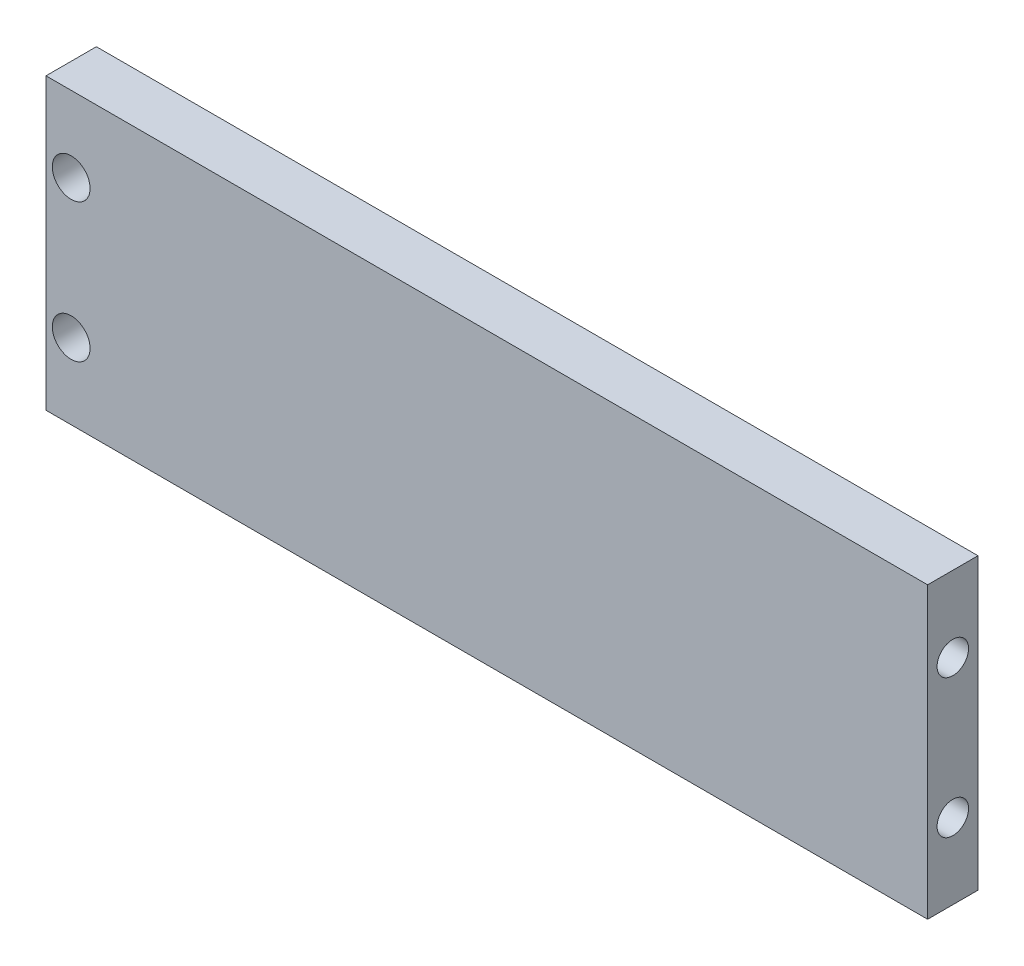
ISO-10303-21;
HEADER;
FILE_DESCRIPTION(('STEP AP214'),'2;1');
FILE_NAME('part.step','',(''),(''),'','','');
FILE_SCHEMA(('AUTOMOTIVE_DESIGN { 1 0 10303 214 1 1 1 1 }'));
ENDSEC;
DATA;
#1=APPLICATION_CONTEXT('core data for automotive mechanical design processes');
#2=APPLICATION_PROTOCOL_DEFINITION('international standard','automotive_design',2000,#1);
#3=PRODUCT_CONTEXT('',#1,'mechanical');
#4=PRODUCT('Part','Part','',(#3));
#5=PRODUCT_RELATED_PRODUCT_CATEGORY('part','',(#4));
#6=PRODUCT_DEFINITION_FORMATION('','',#4);
#7=PRODUCT_DEFINITION_CONTEXT('part definition',#1,'design');
#8=PRODUCT_DEFINITION('design','',#6,#7);
#9=PRODUCT_DEFINITION_SHAPE('','',#8);
#10=(LENGTH_UNIT() NAMED_UNIT(*) SI_UNIT(.MILLI.,.METRE.));
#11=(NAMED_UNIT(*) PLANE_ANGLE_UNIT() SI_UNIT($,.RADIAN.));
#12=(NAMED_UNIT(*) SI_UNIT($,.STERADIAN.) SOLID_ANGLE_UNIT());
#13=UNCERTAINTY_MEASURE_WITH_UNIT(LENGTH_MEASURE(1.E-05),#10,'distance_accuracy_value','');
#14=(GEOMETRIC_REPRESENTATION_CONTEXT(3) GLOBAL_UNCERTAINTY_ASSIGNED_CONTEXT((#13)) GLOBAL_UNIT_ASSIGNED_CONTEXT((#10,
#11,#12)) REPRESENTATION_CONTEXT('',''));
#15=CARTESIAN_POINT('',(0.,0.,0.));
#16=DIRECTION('',(0.,0.,1.));
#17=DIRECTION('',(1.,0.,0.));
#18=AXIS2_PLACEMENT_3D('',#15,#16,#17);
#19=CARTESIAN_POINT('',(0.,0.,4.));
#20=DIRECTION('',(1.,0.,0.));
#21=DIRECTION('',(0.,0.,-1.));
#22=AXIS2_PLACEMENT_3D('',#19,#20,#21);
#23=PLANE('',#22);
#24=DIRECTION('',(0.,-1.,0.));
#25=VECTOR('',#24,1.);
#26=CARTESIAN_POINT('',(0.,0.,0.));
#27=LINE('',#26,#25);
#28=CARTESIAN_POINT('',(0.,0.,0.));
#29=VERTEX_POINT('',#28);
#30=CARTESIAN_POINT('',(0.,-23.,0.));
#31=VERTEX_POINT('',#30);
#32=EDGE_CURVE('E101',#29,#31,#27,.T.);
#33=ORIENTED_EDGE('',*,*,#32,.T.);
#34=DIRECTION('',(0.,0.,-1.));
#35=VECTOR('',#34,1.);
#36=CARTESIAN_POINT('',(0.,-23.,4.));
#37=LINE('',#36,#35);
#38=CARTESIAN_POINT('',(0.,-23.,4.));
#39=VERTEX_POINT('',#38);
#40=EDGE_CURVE('E11',#39,#31,#37,.T.);
#41=ORIENTED_EDGE('',*,*,#40,.F.);
#42=DIRECTION('',(0.,-1.,0.));
#43=VECTOR('',#42,1.);
#44=CARTESIAN_POINT('',(0.,0.,4.));
#45=LINE('',#44,#43);
#46=CARTESIAN_POINT('',(0.,0.,4.));
#47=VERTEX_POINT('',#46);
#48=EDGE_CURVE('E88',#47,#39,#45,.T.);
#49=ORIENTED_EDGE('',*,*,#48,.F.);
#50=DIRECTION('',(0.,0.,-1.));
#51=VECTOR('',#50,1.);
#52=CARTESIAN_POINT('',(0.,0.,4.));
#53=LINE('',#52,#51);
#54=EDGE_CURVE('E97',#47,#29,#53,.T.);
#55=ORIENTED_EDGE('',*,*,#54,.T.);
#56=EDGE_LOOP('',(#33,#41,#49,#55));
#57=FACE_BOUND('',#56,.T.);
#58=ADVANCED_FACE('F35',(#57),#23,.F.);
#59=CARTESIAN_POINT('',(0.,-23.,4.));
#60=DIRECTION('',(0.,1.,0.));
#61=DIRECTION('',(0.,0.,1.));
#62=AXIS2_PLACEMENT_3D('',#59,#60,#61);
#63=PLANE('',#62);
#64=CARTESIAN_POINT('',(15.,-23.,2.));
#65=DIRECTION('',(0.,-1.,0.));
#66=DIRECTION('',(0.,0.,-1.));
#67=AXIS2_PLACEMENT_3D('',#64,#65,#66);
#68=CIRCLE('',#67,1.25);
#69=CARTESIAN_POINT('',(15.,-23.,0.750000000000002));
#70=VERTEX_POINT('',#69);
#71=EDGE_CURVE('E128',#70,#70,#68,.T.);
#72=ORIENTED_EDGE('',*,*,#71,.F.);
#73=EDGE_LOOP('',(#72));
#74=FACE_BOUND('',#73,.T.);
#75=CARTESIAN_POINT('',(35.,-23.,2.));
#76=DIRECTION('',(0.,-1.,0.));
#77=DIRECTION('',(0.,0.,-1.));
#78=AXIS2_PLACEMENT_3D('',#75,#76,#77);
#79=CIRCLE('',#78,1.25);
#80=CARTESIAN_POINT('',(35.,-23.,0.750000000000002));
#81=VERTEX_POINT('',#80);
#82=EDGE_CURVE('E134',#81,#81,#79,.T.);
#83=ORIENTED_EDGE('',*,*,#82,.F.);
#84=EDGE_LOOP('',(#83));
#85=FACE_BOUND('',#84,.T.);
#86=CARTESIAN_POINT('',(55.,-23.,2.00000000000001));
#87=DIRECTION('',(0.,-1.,0.));
#88=DIRECTION('',(0.,0.,-1.));
#89=AXIS2_PLACEMENT_3D('',#86,#87,#88);
#90=CIRCLE('',#89,1.25);
#91=CARTESIAN_POINT('',(55.,-23.,0.750000000000009));
#92=VERTEX_POINT('',#91);
#93=EDGE_CURVE('E115',#92,#92,#90,.T.);
#94=ORIENTED_EDGE('',*,*,#93,.F.);
#95=EDGE_LOOP('',(#94));
#96=FACE_BOUND('',#95,.T.);
#97=DIRECTION('',(1.,0.,0.));
#98=VECTOR('',#97,1.);
#99=CARTESIAN_POINT('',(0.,-23.,0.));
#100=LINE('',#99,#98);
#101=CARTESIAN_POINT('',(70.,-23.,0.));
#102=VERTEX_POINT('',#101);
#103=EDGE_CURVE('E92',#31,#102,#100,.T.);
#104=ORIENTED_EDGE('',*,*,#103,.T.);
#105=DIRECTION('',(0.,0.,-1.));
#106=VECTOR('',#105,1.);
#107=CARTESIAN_POINT('',(70.,-23.,4.));
#108=LINE('',#107,#106);
#109=CARTESIAN_POINT('',(70.,-23.,4.));
#110=VERTEX_POINT('',#109);
#111=EDGE_CURVE('E44',#110,#102,#108,.T.);
#112=ORIENTED_EDGE('',*,*,#111,.F.);
#113=DIRECTION('',(1.,0.,0.));
#114=VECTOR('',#113,1.);
#115=CARTESIAN_POINT('',(0.,-23.,4.));
#116=LINE('',#115,#114);
#117=EDGE_CURVE('E83',#39,#110,#116,.T.);
#118=ORIENTED_EDGE('',*,*,#117,.F.);
#119=ORIENTED_EDGE('',*,*,#40,.T.);
#120=EDGE_LOOP('',(#104,#112,#118,#119));
#121=FACE_BOUND('',#120,.T.);
#122=ADVANCED_FACE('F91',(#74,#85,#96,#121),#63,.F.);
#123=CARTESIAN_POINT('',(70.,0.,4.));
#124=DIRECTION('',(-1.,0.,0.));
#125=DIRECTION('',(0.,0.,1.));
#126=AXIS2_PLACEMENT_3D('',#123,#124,#125);
#127=PLANE('',#126);
#128=CARTESIAN_POINT('',(70.,-6.,2.));
#129=DIRECTION('',(1.,0.,0.));
#130=DIRECTION('',(0.,0.,-1.));
#131=AXIS2_PLACEMENT_3D('',#128,#129,#130);
#132=CIRCLE('',#131,1.25);
#133=CARTESIAN_POINT('',(70.,-6.,0.749999999999998));
#134=VERTEX_POINT('',#133);
#135=EDGE_CURVE('E144',#134,#134,#132,.T.);
#136=ORIENTED_EDGE('',*,*,#135,.F.);
#137=EDGE_LOOP('',(#136));
#138=FACE_BOUND('',#137,.T.);
#139=CARTESIAN_POINT('',(70.,-17.,2.));
#140=DIRECTION('',(1.,0.,0.));
#141=DIRECTION('',(0.,0.,-1.));
#142=AXIS2_PLACEMENT_3D('',#139,#140,#141);
#143=CIRCLE('',#142,1.25);
#144=CARTESIAN_POINT('',(70.,-17.,0.749999999999997));
#145=VERTEX_POINT('',#144);
#146=EDGE_CURVE('E127',#145,#145,#143,.T.);
#147=ORIENTED_EDGE('',*,*,#146,.F.);
#148=EDGE_LOOP('',(#147));
#149=FACE_BOUND('',#148,.T.);
#150=DIRECTION('',(0.,1.,0.));
#151=VECTOR('',#150,1.);
#152=CARTESIAN_POINT('',(70.,0.,0.));
#153=LINE('',#152,#151);
#154=CARTESIAN_POINT('',(70.,0.,0.));
#155=VERTEX_POINT('',#154);
#156=EDGE_CURVE('E70',#102,#155,#153,.T.);
#157=ORIENTED_EDGE('',*,*,#156,.T.);
#158=DIRECTION('',(0.,0.,-1.));
#159=VECTOR('',#158,1.);
#160=CARTESIAN_POINT('',(70.,0.,4.));
#161=LINE('',#160,#159);
#162=CARTESIAN_POINT('',(70.,0.,4.));
#163=VERTEX_POINT('',#162);
#164=EDGE_CURVE('E93',#163,#155,#161,.T.);
#165=ORIENTED_EDGE('',*,*,#164,.F.);
#166=DIRECTION('',(0.,1.,0.));
#167=VECTOR('',#166,1.);
#168=CARTESIAN_POINT('',(70.,0.,4.));
#169=LINE('',#168,#167);
#170=EDGE_CURVE('E86',#110,#163,#169,.T.);
#171=ORIENTED_EDGE('',*,*,#170,.F.);
#172=ORIENTED_EDGE('',*,*,#111,.T.);
#173=EDGE_LOOP('',(#157,#165,#171,#172));
#174=FACE_BOUND('',#173,.T.);
#175=ADVANCED_FACE('F95',(#138,#149,#174),#127,.F.);
#176=CARTESIAN_POINT('',(0.,0.,4.));
#177=DIRECTION('',(0.,-1.,0.));
#178=DIRECTION('',(0.,0.,-1.));
#179=AXIS2_PLACEMENT_3D('',#176,#177,#178);
#180=PLANE('',#179);
#181=DIRECTION('',(-1.,0.,0.));
#182=VECTOR('',#181,1.);
#183=CARTESIAN_POINT('',(0.,0.,0.));
#184=LINE('',#183,#182);
#185=EDGE_CURVE('E76',#155,#29,#184,.T.);
#186=ORIENTED_EDGE('',*,*,#185,.T.);
#187=ORIENTED_EDGE('',*,*,#54,.F.);
#188=DIRECTION('',(-1.,0.,0.));
#189=VECTOR('',#188,1.);
#190=CARTESIAN_POINT('',(0.,0.,4.));
#191=LINE('',#190,#189);
#192=EDGE_CURVE('E53',#163,#47,#191,.T.);
#193=ORIENTED_EDGE('',*,*,#192,.F.);
#194=ORIENTED_EDGE('',*,*,#164,.T.);
#195=EDGE_LOOP('',(#186,#187,#193,#194));
#196=FACE_BOUND('',#195,.T.);
#197=ADVANCED_FACE('F156',(#196),#180,.F.);
#198=CARTESIAN_POINT('',(0.,0.,4.));
#199=DIRECTION('',(0.,0.,1.));
#200=DIRECTION('',(1.,0.,0.));
#201=AXIS2_PLACEMENT_3D('',#198,#199,#200);
#202=PLANE('',#201);
#203=CARTESIAN_POINT('',(2.,-6.,4.));
#204=DIRECTION('',(0.,0.,1.));
#205=DIRECTION('',(1.,0.,0.));
#206=AXIS2_PLACEMENT_3D('',#203,#204,#205);
#207=CIRCLE('',#206,1.5);
#208=CARTESIAN_POINT('',(3.5,-6.,4.));
#209=VERTEX_POINT('',#208);
#210=EDGE_CURVE('E111',#209,#209,#207,.T.);
#211=ORIENTED_EDGE('',*,*,#210,.F.);
#212=EDGE_LOOP('',(#211));
#213=FACE_BOUND('',#212,.T.);
#214=CARTESIAN_POINT('',(2.,-17.,4.));
#215=DIRECTION('',(0.,0.,1.));
#216=DIRECTION('',(1.,0.,0.));
#217=AXIS2_PLACEMENT_3D('',#214,#215,#216);
#218=CIRCLE('',#217,1.5);
#219=CARTESIAN_POINT('',(3.5,-17.,4.));
#220=VERTEX_POINT('',#219);
#221=EDGE_CURVE('E117',#220,#220,#218,.T.);
#222=ORIENTED_EDGE('',*,*,#221,.F.);
#223=EDGE_LOOP('',(#222));
#224=FACE_BOUND('',#223,.T.);
#225=ORIENTED_EDGE('',*,*,#48,.T.);
#226=ORIENTED_EDGE('',*,*,#117,.T.);
#227=ORIENTED_EDGE('',*,*,#170,.T.);
#228=ORIENTED_EDGE('',*,*,#192,.T.);
#229=EDGE_LOOP('',(#225,#226,#227,#228));
#230=FACE_BOUND('',#229,.T.);
#231=ADVANCED_FACE('F84',(#213,#224,#230),#202,.T.);
#232=CARTESIAN_POINT('',(0.,0.,0.));
#233=DIRECTION('',(0.,0.,1.));
#234=DIRECTION('',(1.,0.,0.));
#235=AXIS2_PLACEMENT_3D('',#232,#233,#234);
#236=PLANE('',#235);
#237=CARTESIAN_POINT('',(2.,-6.,0.));
#238=DIRECTION('',(0.,0.,1.));
#239=DIRECTION('',(1.,0.,0.));
#240=AXIS2_PLACEMENT_3D('',#237,#238,#239);
#241=CIRCLE('',#240,1.5);
#242=CARTESIAN_POINT('',(3.5,-6.,0.));
#243=VERTEX_POINT('',#242);
#244=EDGE_CURVE('E38',#243,#243,#241,.T.);
#245=ORIENTED_EDGE('',*,*,#244,.T.);
#246=EDGE_LOOP('',(#245));
#247=FACE_BOUND('',#246,.T.);
#248=CARTESIAN_POINT('',(2.,-17.,0.));
#249=DIRECTION('',(0.,0.,1.));
#250=DIRECTION('',(1.,0.,0.));
#251=AXIS2_PLACEMENT_3D('',#248,#249,#250);
#252=CIRCLE('',#251,1.5);
#253=CARTESIAN_POINT('',(3.5,-17.,0.));
#254=VERTEX_POINT('',#253);
#255=EDGE_CURVE('E109',#254,#254,#252,.T.);
#256=ORIENTED_EDGE('',*,*,#255,.T.);
#257=EDGE_LOOP('',(#256));
#258=FACE_BOUND('',#257,.T.);
#259=ORIENTED_EDGE('',*,*,#32,.F.);
#260=ORIENTED_EDGE('',*,*,#185,.F.);
#261=ORIENTED_EDGE('',*,*,#156,.F.);
#262=ORIENTED_EDGE('',*,*,#103,.F.);
#263=EDGE_LOOP('',(#259,#260,#261,#262));
#264=FACE_BOUND('',#263,.T.);
#265=ADVANCED_FACE('F172',(#247,#258,#264),#236,.F.);
#266=CARTESIAN_POINT('',(60.,-17.,2.));
#267=DIRECTION('',(1.,0.,0.));
#268=DIRECTION('',(0.,0.,-1.));
#269=AXIS2_PLACEMENT_3D('',#266,#267,#268);
#270=CYLINDRICAL_SURFACE('',#269,1.25);
#271=CARTESIAN_POINT('',(60.,-17.,2.));
#272=DIRECTION('',(1.,0.,0.));
#273=DIRECTION('',(0.,0.,-1.));
#274=AXIS2_PLACEMENT_3D('',#271,#272,#273);
#275=CIRCLE('',#274,1.25);
#276=CARTESIAN_POINT('',(60.,-17.,0.749999999999997));
#277=VERTEX_POINT('',#276);
#278=EDGE_CURVE('E147',#277,#277,#275,.T.);
#279=ORIENTED_EDGE('',*,*,#278,.F.);
#280=EDGE_LOOP('',(#279));
#281=FACE_BOUND('',#280,.T.);
#282=ORIENTED_EDGE('',*,*,#146,.T.);
#283=EDGE_LOOP('',(#282));
#284=FACE_BOUND('',#283,.T.);
#285=ADVANCED_FACE('F153',(#281,#284),#270,.F.);
#286=CARTESIAN_POINT('',(60.,-17.,2.));
#287=DIRECTION('',(1.,0.,0.));
#288=DIRECTION('',(0.,0.,-1.));
#289=AXIS2_PLACEMENT_3D('',#286,#287,#288);
#290=PLANE('',#289);
#291=ORIENTED_EDGE('',*,*,#278,.T.);
#292=EDGE_LOOP('',(#291));
#293=FACE_BOUND('',#292,.T.);
#294=ADVANCED_FACE('F180',(#293),#290,.T.);
#295=CARTESIAN_POINT('',(60.,-6.,2.));
#296=DIRECTION('',(1.,0.,0.));
#297=DIRECTION('',(0.,0.,-1.));
#298=AXIS2_PLACEMENT_3D('',#295,#296,#297);
#299=CYLINDRICAL_SURFACE('',#298,1.25);
#300=CARTESIAN_POINT('',(60.,-6.,2.));
#301=DIRECTION('',(1.,0.,0.));
#302=DIRECTION('',(0.,0.,-1.));
#303=AXIS2_PLACEMENT_3D('',#300,#301,#302);
#304=CIRCLE('',#303,1.25);
#305=CARTESIAN_POINT('',(60.,-6.,0.749999999999998));
#306=VERTEX_POINT('',#305);
#307=EDGE_CURVE('E104',#306,#306,#304,.T.);
#308=ORIENTED_EDGE('',*,*,#307,.F.);
#309=EDGE_LOOP('',(#308));
#310=FACE_BOUND('',#309,.T.);
#311=ORIENTED_EDGE('',*,*,#135,.T.);
#312=EDGE_LOOP('',(#311));
#313=FACE_BOUND('',#312,.T.);
#314=ADVANCED_FACE('F188',(#310,#313),#299,.F.);
#315=CARTESIAN_POINT('',(60.,-6.,2.));
#316=DIRECTION('',(1.,0.,0.));
#317=DIRECTION('',(0.,0.,-1.));
#318=AXIS2_PLACEMENT_3D('',#315,#316,#317);
#319=PLANE('',#318);
#320=ORIENTED_EDGE('',*,*,#307,.T.);
#321=EDGE_LOOP('',(#320));
#322=FACE_BOUND('',#321,.T.);
#323=ADVANCED_FACE('F192',(#322),#319,.T.);
#324=CARTESIAN_POINT('',(55.,-13.,2.00000000000001));
#325=DIRECTION('',(0.,-1.,0.));
#326=DIRECTION('',(0.,0.,-1.));
#327=AXIS2_PLACEMENT_3D('',#324,#325,#326);
#328=CYLINDRICAL_SURFACE('',#327,1.25);
#329=CARTESIAN_POINT('',(55.,-13.,2.00000000000001));
#330=DIRECTION('',(0.,-1.,0.));
#331=DIRECTION('',(0.,0.,-1.));
#332=AXIS2_PLACEMENT_3D('',#329,#330,#331);
#333=CIRCLE('',#332,1.25);
#334=CARTESIAN_POINT('',(55.,-13.,0.750000000000009));
#335=VERTEX_POINT('',#334);
#336=EDGE_CURVE('E137',#335,#335,#333,.T.);
#337=ORIENTED_EDGE('',*,*,#336,.F.);
#338=EDGE_LOOP('',(#337));
#339=FACE_BOUND('',#338,.T.);
#340=ORIENTED_EDGE('',*,*,#93,.T.);
#341=EDGE_LOOP('',(#340));
#342=FACE_BOUND('',#341,.T.);
#343=ADVANCED_FACE('F196',(#339,#342),#328,.F.);
#344=CARTESIAN_POINT('',(55.,-13.,2.00000000000001));
#345=DIRECTION('',(0.,-1.,0.));
#346=DIRECTION('',(0.,0.,-1.));
#347=AXIS2_PLACEMENT_3D('',#344,#345,#346);
#348=PLANE('',#347);
#349=ORIENTED_EDGE('',*,*,#336,.T.);
#350=EDGE_LOOP('',(#349));
#351=FACE_BOUND('',#350,.T.);
#352=ADVANCED_FACE('F200',(#351),#348,.T.);
#353=CARTESIAN_POINT('',(35.,-13.,2.));
#354=DIRECTION('',(0.,-1.,0.));
#355=DIRECTION('',(0.,0.,-1.));
#356=AXIS2_PLACEMENT_3D('',#353,#354,#355);
#357=CYLINDRICAL_SURFACE('',#356,1.25);
#358=CARTESIAN_POINT('',(35.,-13.,2.));
#359=DIRECTION('',(0.,-1.,0.));
#360=DIRECTION('',(0.,0.,-1.));
#361=AXIS2_PLACEMENT_3D('',#358,#359,#360);
#362=CIRCLE('',#361,1.25);
#363=CARTESIAN_POINT('',(35.,-13.,0.750000000000002));
#364=VERTEX_POINT('',#363);
#365=EDGE_CURVE('E131',#364,#364,#362,.T.);
#366=ORIENTED_EDGE('',*,*,#365,.F.);
#367=EDGE_LOOP('',(#366));
#368=FACE_BOUND('',#367,.T.);
#369=ORIENTED_EDGE('',*,*,#82,.T.);
#370=EDGE_LOOP('',(#369));
#371=FACE_BOUND('',#370,.T.);
#372=ADVANCED_FACE('F204',(#368,#371),#357,.F.);
#373=CARTESIAN_POINT('',(35.,-13.,2.));
#374=DIRECTION('',(0.,-1.,0.));
#375=DIRECTION('',(0.,0.,-1.));
#376=AXIS2_PLACEMENT_3D('',#373,#374,#375);
#377=PLANE('',#376);
#378=ORIENTED_EDGE('',*,*,#365,.T.);
#379=EDGE_LOOP('',(#378));
#380=FACE_BOUND('',#379,.T.);
#381=ADVANCED_FACE('F208',(#380),#377,.T.);
#382=CARTESIAN_POINT('',(15.,-13.,2.));
#383=DIRECTION('',(0.,-1.,0.));
#384=DIRECTION('',(0.,0.,-1.));
#385=AXIS2_PLACEMENT_3D('',#382,#383,#384);
#386=CYLINDRICAL_SURFACE('',#385,1.25);
#387=CARTESIAN_POINT('',(15.,-13.,2.));
#388=DIRECTION('',(0.,-1.,0.));
#389=DIRECTION('',(0.,0.,-1.));
#390=AXIS2_PLACEMENT_3D('',#387,#388,#389);
#391=CIRCLE('',#390,1.25);
#392=CARTESIAN_POINT('',(15.,-13.,0.750000000000002));
#393=VERTEX_POINT('',#392);
#394=EDGE_CURVE('E124',#393,#393,#391,.T.);
#395=ORIENTED_EDGE('',*,*,#394,.F.);
#396=EDGE_LOOP('',(#395));
#397=FACE_BOUND('',#396,.T.);
#398=ORIENTED_EDGE('',*,*,#71,.T.);
#399=EDGE_LOOP('',(#398));
#400=FACE_BOUND('',#399,.T.);
#401=ADVANCED_FACE('F212',(#397,#400),#386,.F.);
#402=CARTESIAN_POINT('',(15.,-13.,2.));
#403=DIRECTION('',(0.,-1.,0.));
#404=DIRECTION('',(0.,0.,-1.));
#405=AXIS2_PLACEMENT_3D('',#402,#403,#404);
#406=PLANE('',#405);
#407=ORIENTED_EDGE('',*,*,#394,.T.);
#408=EDGE_LOOP('',(#407));
#409=FACE_BOUND('',#408,.T.);
#410=ADVANCED_FACE('F216',(#409),#406,.T.);
#411=CARTESIAN_POINT('',(2.,-17.,-6.));
#412=DIRECTION('',(0.,0.,1.));
#413=DIRECTION('',(1.,0.,0.));
#414=AXIS2_PLACEMENT_3D('',#411,#412,#413);
#415=CYLINDRICAL_SURFACE('',#414,1.5);
#416=ORIENTED_EDGE('',*,*,#221,.T.);
#417=EDGE_LOOP('',(#416));
#418=FACE_BOUND('',#417,.T.);
#419=ORIENTED_EDGE('',*,*,#255,.F.);
#420=EDGE_LOOP('',(#419));
#421=FACE_BOUND('',#420,.T.);
#422=ADVANCED_FACE('F220',(#418,#421),#415,.F.);
#423=CARTESIAN_POINT('',(2.,-6.,-6.));
#424=DIRECTION('',(0.,0.,1.));
#425=DIRECTION('',(1.,0.,0.));
#426=AXIS2_PLACEMENT_3D('',#423,#424,#425);
#427=CYLINDRICAL_SURFACE('',#426,1.5);
#428=ORIENTED_EDGE('',*,*,#210,.T.);
#429=EDGE_LOOP('',(#428));
#430=FACE_BOUND('',#429,.T.);
#431=ORIENTED_EDGE('',*,*,#244,.F.);
#432=EDGE_LOOP('',(#431));
#433=FACE_BOUND('',#432,.T.);
#434=ADVANCED_FACE('F224',(#430,#433),#427,.F.);
#435=CLOSED_SHELL('',(#58,#122,#175,#197,#231,#265,#285,#294,#314,#323,#343,#352,#372,#381,#401,
#410,#422,#434));
#436=MANIFOLD_SOLID_BREP('B2',#435);
#437=ADVANCED_BREP_SHAPE_REPRESENTATION('',(#18,#436),#14);
#438=SHAPE_DEFINITION_REPRESENTATION(#9,#437);
ENDSEC;
END-ISO-10303-21;
